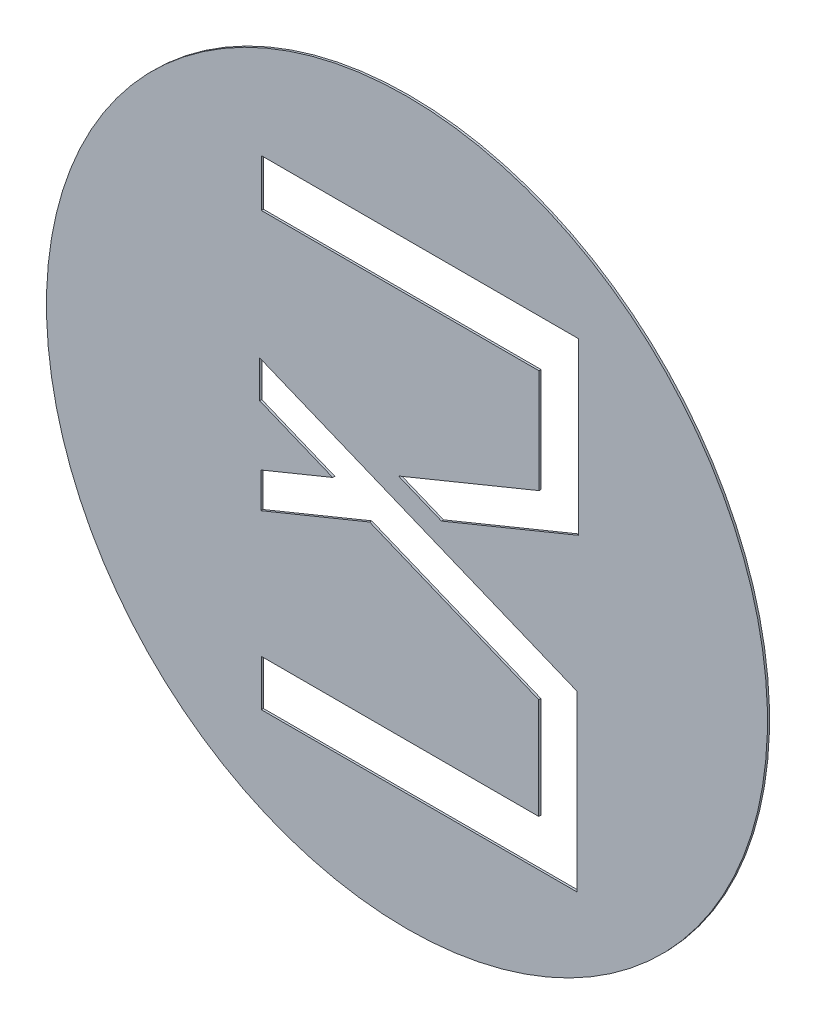
ISO-10303-21;
HEADER;
FILE_DESCRIPTION(('STEP AP214'),'2;1');
FILE_NAME('part.step','',(''),(''),'','','');
FILE_SCHEMA(('AUTOMOTIVE_DESIGN { 1 0 10303 214 1 1 1 1 }'));
ENDSEC;
DATA;
#1=APPLICATION_CONTEXT('core data for automotive mechanical design processes');
#2=APPLICATION_PROTOCOL_DEFINITION('international standard','automotive_design',2000,#1);
#3=PRODUCT_CONTEXT('',#1,'mechanical');
#4=PRODUCT('Part','Part','',(#3));
#5=PRODUCT_RELATED_PRODUCT_CATEGORY('part','',(#4));
#6=PRODUCT_DEFINITION_FORMATION('','',#4);
#7=PRODUCT_DEFINITION_CONTEXT('part definition',#1,'design');
#8=PRODUCT_DEFINITION('design','',#6,#7);
#9=PRODUCT_DEFINITION_SHAPE('','',#8);
#10=(LENGTH_UNIT() NAMED_UNIT(*) SI_UNIT(.MILLI.,.METRE.));
#11=(NAMED_UNIT(*) PLANE_ANGLE_UNIT() SI_UNIT($,.RADIAN.));
#12=(NAMED_UNIT(*) SI_UNIT($,.STERADIAN.) SOLID_ANGLE_UNIT());
#13=UNCERTAINTY_MEASURE_WITH_UNIT(LENGTH_MEASURE(1.E-05),#10,'distance_accuracy_value','');
#14=(GEOMETRIC_REPRESENTATION_CONTEXT(3) GLOBAL_UNCERTAINTY_ASSIGNED_CONTEXT((#13)) GLOBAL_UNIT_ASSIGNED_CONTEXT((#10,
#11,#12)) REPRESENTATION_CONTEXT('',''));
#15=CARTESIAN_POINT('',(0.,0.,0.));
#16=DIRECTION('',(0.,0.,1.));
#17=DIRECTION('',(1.,0.,0.));
#18=AXIS2_PLACEMENT_3D('',#15,#16,#17);
#19=CARTESIAN_POINT('',(1.1645974941225,1.6099234272431,1.74900000742));
#20=DIRECTION('',(1.,0.,0.));
#21=DIRECTION('',(0.,0.,-1.));
#22=AXIS2_PLACEMENT_3D('',#19,#20,#21);
#23=PLANE('',#22);
#24=DIRECTION('',(0.,0.,1.));
#25=VECTOR('',#24,1.);
#26=CARTESIAN_POINT('',(1.1645974941225,1.6266998240997,1.74900000742));
#27=LINE('',#26,#25);
#28=CARTESIAN_POINT('',(1.1645974941225,1.6266998240997,1.74900000742));
#29=VERTEX_POINT('',#28);
#30=CARTESIAN_POINT('',(1.1645974941225,1.6266998240997,1.74940000742));
#31=VERTEX_POINT('',#30);
#32=EDGE_CURVE('E11',#29,#31,#27,.T.);
#33=ORIENTED_EDGE('',*,*,#32,.F.);
#34=DIRECTION('',(0.,1.,0.));
#35=VECTOR('',#34,1.);
#36=CARTESIAN_POINT('',(1.1645974941225,1.5931470303865,1.74900000742));
#37=LINE('',#36,#35);
#38=CARTESIAN_POINT('',(1.1645974941225,1.5931470303865,1.74900000742));
#39=VERTEX_POINT('',#38);
#40=EDGE_CURVE('E24',#39,#29,#37,.T.);
#41=ORIENTED_EDGE('',*,*,#40,.F.);
#42=DIRECTION('',(0.,0.,1.));
#43=VECTOR('',#42,1.);
#44=CARTESIAN_POINT('',(1.1645974941225,1.5931470303865,1.74900000742));
#45=LINE('',#44,#43);
#46=CARTESIAN_POINT('',(1.1645974941225,1.5931470303865,1.74940000742));
#47=VERTEX_POINT('',#46);
#48=EDGE_CURVE('E322',#39,#47,#45,.T.);
#49=ORIENTED_EDGE('',*,*,#48,.T.);
#50=DIRECTION('',(0.,-1.,0.));
#51=VECTOR('',#50,1.);
#52=CARTESIAN_POINT('',(1.1645974941225,1.6266998240997,1.74940000742));
#53=LINE('',#52,#51);
#54=EDGE_CURVE('E319',#31,#47,#53,.T.);
#55=ORIENTED_EDGE('',*,*,#54,.F.);
#56=EDGE_LOOP('',(#33,#41,#49,#55));
#57=FACE_BOUND('',#56,.T.);
#58=ADVANCED_FACE('F17',(#57),#23,.F.);
#59=CARTESIAN_POINT('',(1.1341423982248,1.5931470303865,1.74900000742));
#60=DIRECTION('',(0.,-1.,0.));
#61=DIRECTION('',(0.,0.,-1.));
#62=AXIS2_PLACEMENT_3D('',#59,#60,#61);
#63=PLANE('',#62);
#64=ORIENTED_EDGE('',*,*,#48,.F.);
#65=DIRECTION('',(1.,0.,0.));
#66=VECTOR('',#65,1.);
#67=CARTESIAN_POINT('',(1.1036873023271,1.5931470303865,1.74900000742));
#68=LINE('',#67,#66);
#69=CARTESIAN_POINT('',(1.1036873023271,1.5931470303865,1.74900000742));
#70=VERTEX_POINT('',#69);
#71=EDGE_CURVE('E316',#70,#39,#68,.T.);
#72=ORIENTED_EDGE('',*,*,#71,.F.);
#73=DIRECTION('',(0.,0.,1.));
#74=VECTOR('',#73,1.);
#75=CARTESIAN_POINT('',(1.1036873023271,1.5931470303865,1.74900000742));
#76=LINE('',#75,#74);
#77=CARTESIAN_POINT('',(1.1036873023271,1.5931470303865,1.74940000742));
#78=VERTEX_POINT('',#77);
#79=EDGE_CURVE('E314',#70,#78,#76,.T.);
#80=ORIENTED_EDGE('',*,*,#79,.T.);
#81=DIRECTION('',(-1.,0.,0.));
#82=VECTOR('',#81,1.);
#83=CARTESIAN_POINT('',(1.1645974941225,1.5931470303865,1.74940000742));
#84=LINE('',#83,#82);
#85=EDGE_CURVE('E311',#47,#78,#84,.T.);
#86=ORIENTED_EDGE('',*,*,#85,.F.);
#87=EDGE_LOOP('',(#64,#72,#80,#86));
#88=FACE_BOUND('',#87,.T.);
#89=ADVANCED_FACE('F368',(#88),#63,.F.);
#90=CARTESIAN_POINT('',(1.1036873023271,1.5976076616901,1.74900000742));
#91=DIRECTION('',(-1.,0.,0.));
#92=DIRECTION('',(0.,0.,1.));
#93=AXIS2_PLACEMENT_3D('',#90,#91,#92);
#94=PLANE('',#93);
#95=ORIENTED_EDGE('',*,*,#79,.F.);
#96=DIRECTION('',(0.,-1.,0.));
#97=VECTOR('',#96,1.);
#98=CARTESIAN_POINT('',(1.1036873023271,1.6020682929937,1.74900000742));
#99=LINE('',#98,#97);
#100=CARTESIAN_POINT('',(1.1036873023271,1.6020682929937,1.74900000742));
#101=VERTEX_POINT('',#100);
#102=EDGE_CURVE('E308',#101,#70,#99,.T.);
#103=ORIENTED_EDGE('',*,*,#102,.F.);
#104=DIRECTION('',(0.,0.,1.));
#105=VECTOR('',#104,1.);
#106=CARTESIAN_POINT('',(1.1036873023271,1.6020682929937,1.74900000742));
#107=LINE('',#106,#105);
#108=CARTESIAN_POINT('',(1.1036873023271,1.6020682929937,1.74940000742));
#109=VERTEX_POINT('',#108);
#110=EDGE_CURVE('E306',#101,#109,#107,.T.);
#111=ORIENTED_EDGE('',*,*,#110,.T.);
#112=DIRECTION('',(0.,1.,0.));
#113=VECTOR('',#112,1.);
#114=CARTESIAN_POINT('',(1.1036873023271,1.5931470303865,1.74940000742));
#115=LINE('',#114,#113);
#116=EDGE_CURVE('E303',#78,#109,#115,.T.);
#117=ORIENTED_EDGE('',*,*,#116,.F.);
#118=EDGE_LOOP('',(#95,#103,#111,#117));
#119=FACE_BOUND('',#118,.T.);
#120=ADVANCED_FACE('F365',(#119),#94,.F.);
#121=CARTESIAN_POINT('',(1.1304576992269,1.6020682929937,1.74900000742));
#122=DIRECTION('',(0.,1.,0.));
#123=DIRECTION('',(0.,0.,1.));
#124=AXIS2_PLACEMENT_3D('',#121,#122,#123);
#125=PLANE('',#124);
#126=ORIENTED_EDGE('',*,*,#110,.F.);
#127=DIRECTION('',(-1.,0.,0.));
#128=VECTOR('',#127,1.);
#129=CARTESIAN_POINT('',(1.1572280961267,1.6020682929937,1.74900000742));
#130=LINE('',#129,#128);
#131=CARTESIAN_POINT('',(1.1572280961267,1.6020682929937,1.74900000742));
#132=VERTEX_POINT('',#131);
#133=EDGE_CURVE('E300',#132,#101,#130,.T.);
#134=ORIENTED_EDGE('',*,*,#133,.F.);
#135=DIRECTION('',(0.,0.,1.));
#136=VECTOR('',#135,1.);
#137=CARTESIAN_POINT('',(1.1572280961267,1.6020682929937,1.74900000742));
#138=LINE('',#137,#136);
#139=CARTESIAN_POINT('',(1.1572280961267,1.6020682929937,1.74940000742));
#140=VERTEX_POINT('',#139);
#141=EDGE_CURVE('E298',#132,#140,#138,.T.);
#142=ORIENTED_EDGE('',*,*,#141,.T.);
#143=DIRECTION('',(1.,0.,0.));
#144=VECTOR('',#143,1.);
#145=CARTESIAN_POINT('',(1.1036873023271,1.6020682929937,1.74940000742));
#146=LINE('',#145,#144);
#147=EDGE_CURVE('E295',#109,#140,#146,.T.);
#148=ORIENTED_EDGE('',*,*,#147,.F.);
#149=EDGE_LOOP('',(#126,#134,#142,#148));
#150=FACE_BOUND('',#149,.T.);
#151=ADVANCED_FACE('F362',(#150),#125,.F.);
#152=CARTESIAN_POINT('',(1.1572280961267,1.6118292382753,1.74900000742));
#153=DIRECTION('',(-1.,0.,0.));
#154=DIRECTION('',(0.,0.,1.));
#155=AXIS2_PLACEMENT_3D('',#152,#153,#154);
#156=PLANE('',#155);
#157=ORIENTED_EDGE('',*,*,#141,.F.);
#158=DIRECTION('',(0.,-1.,0.));
#159=VECTOR('',#158,1.);
#160=CARTESIAN_POINT('',(1.1572280961267,1.6215901835569,1.74900000742));
#161=LINE('',#160,#159);
#162=CARTESIAN_POINT('',(1.1572280961267,1.6215901835569,1.74900000742));
#163=VERTEX_POINT('',#162);
#164=EDGE_CURVE('E292',#163,#132,#161,.T.);
#165=ORIENTED_EDGE('',*,*,#164,.F.);
#166=DIRECTION('',(0.,0.,1.));
#167=VECTOR('',#166,1.);
#168=CARTESIAN_POINT('',(1.1572280961267,1.6215901835569,1.74900000742));
#169=LINE('',#168,#167);
#170=CARTESIAN_POINT('',(1.1572280961267,1.6215901835569,1.74940000742));
#171=VERTEX_POINT('',#170);
#172=EDGE_CURVE('E290',#163,#171,#169,.T.);
#173=ORIENTED_EDGE('',*,*,#172,.T.);
#174=DIRECTION('',(0.,1.,0.));
#175=VECTOR('',#174,1.);
#176=CARTESIAN_POINT('',(1.1572280961267,1.6020682929937,1.74940000742));
#177=LINE('',#176,#175);
#178=EDGE_CURVE('E287',#140,#171,#177,.T.);
#179=ORIENTED_EDGE('',*,*,#178,.F.);
#180=EDGE_LOOP('',(#157,#165,#173,#179));
#181=FACE_BOUND('',#180,.T.);
#182=ADVANCED_FACE('F357',(#181),#156,.F.);
#183=CARTESIAN_POINT('',(1.1409088175475,1.6282781100725,1.74900000742));
#184=DIRECTION('',(-0.3792087365128,-0.925311155316073,0.));
#185=DIRECTION('',(0.,0.,-1.));
#186=AXIS2_PLACEMENT_3D('',#183,#184,#185);
#187=PLANE('',#186);
#188=ORIENTED_EDGE('',*,*,#172,.F.);
#189=DIRECTION('',(0.925311155316073,-0.3792087365128,0.));
#190=VECTOR('',#189,1.);
#191=CARTESIAN_POINT('',(1.1245895389683,1.6349660365881,1.74900000742));
#192=LINE('',#191,#190);
#193=CARTESIAN_POINT('',(1.1245895389683,1.6349660365881,1.74900000742));
#194=VERTEX_POINT('',#193);
#195=EDGE_CURVE('E284',#194,#163,#192,.T.);
#196=ORIENTED_EDGE('',*,*,#195,.F.);
#197=DIRECTION('',(0.,0.,1.));
#198=VECTOR('',#197,1.);
#199=CARTESIAN_POINT('',(1.1245895389683,1.6349660365881,1.74900000742));
#200=LINE('',#199,#198);
#201=CARTESIAN_POINT('',(1.1245895389683,1.6349660365881,1.74940000742));
#202=VERTEX_POINT('',#201);
#203=EDGE_CURVE('E282',#194,#202,#200,.T.);
#204=ORIENTED_EDGE('',*,*,#203,.T.);
#205=DIRECTION('',(-0.925311155316073,0.3792087365128,0.));
#206=VECTOR('',#205,1.);
#207=CARTESIAN_POINT('',(1.1572280961267,1.6215901835569,1.74940000742));
#208=LINE('',#207,#206);
#209=EDGE_CURVE('E279',#171,#202,#208,.T.);
#210=ORIENTED_EDGE('',*,*,#209,.F.);
#211=EDGE_LOOP('',(#188,#196,#204,#210));
#212=FACE_BOUND('',#211,.T.);
#213=ADVANCED_FACE('F353',(#212),#187,.F.);
#214=CARTESIAN_POINT('',(1.1140937586507,1.6306646817735,1.74900000742));
#215=DIRECTION('',(0.379208736510258,-0.925311155317115,0.));
#216=DIRECTION('',(0.,0.,-1.));
#217=AXIS2_PLACEMENT_3D('',#214,#215,#216);
#218=PLANE('',#217);
#219=ORIENTED_EDGE('',*,*,#203,.F.);
#220=DIRECTION('',(0.925311155317115,0.379208736510258,0.));
#221=VECTOR('',#220,1.);
#222=CARTESIAN_POINT('',(1.1035979783331,1.6263633269589,1.74900000742));
#223=LINE('',#222,#221);
#224=CARTESIAN_POINT('',(1.1035979783331,1.6263633269589,1.74900000742));
#225=VERTEX_POINT('',#224);
#226=EDGE_CURVE('E276',#225,#194,#223,.T.);
#227=ORIENTED_EDGE('',*,*,#226,.F.);
#228=DIRECTION('',(0.,0.,1.));
#229=VECTOR('',#228,1.);
#230=CARTESIAN_POINT('',(1.1035979783331,1.6263633269589,1.74900000742));
#231=LINE('',#230,#229);
#232=CARTESIAN_POINT('',(1.1035979783331,1.6263633269589,1.74940000742));
#233=VERTEX_POINT('',#232);
#234=EDGE_CURVE('E274',#225,#233,#231,.T.);
#235=ORIENTED_EDGE('',*,*,#234,.T.);
#236=DIRECTION('',(-0.925311155317115,-0.379208736510258,0.));
#237=VECTOR('',#236,1.);
#238=CARTESIAN_POINT('',(1.1245895389683,1.6349660365881,1.74940000742));
#239=LINE('',#238,#237);
#240=EDGE_CURVE('E271',#202,#233,#239,.T.);
#241=ORIENTED_EDGE('',*,*,#240,.F.);
#242=EDGE_LOOP('',(#219,#227,#235,#241));
#243=FACE_BOUND('',#242,.T.);
#244=ADVANCED_FACE('F350',(#243),#218,.F.);
#245=CARTESIAN_POINT('',(1.1035979783331,1.6297657873966,1.74900000742));
#246=DIRECTION('',(-1.,0.,0.));
#247=DIRECTION('',(0.,0.,1.));
#248=AXIS2_PLACEMENT_3D('',#245,#246,#247);
#249=PLANE('',#248);
#250=ORIENTED_EDGE('',*,*,#234,.F.);
#251=DIRECTION('',(0.,-1.,0.));
#252=VECTOR('',#251,1.);
#253=CARTESIAN_POINT('',(1.1035979783331,1.6331682478343,1.74900000742));
#254=LINE('',#253,#252);
#255=CARTESIAN_POINT('',(1.1035979783331,1.6331682478343,1.74900000742));
#256=VERTEX_POINT('',#255);
#257=EDGE_CURVE('E268',#256,#225,#254,.T.);
#258=ORIENTED_EDGE('',*,*,#257,.F.);
#259=DIRECTION('',(0.,0.,1.));
#260=VECTOR('',#259,1.);
#261=CARTESIAN_POINT('',(1.1035979783331,1.6331682478343,1.74900000742));
#262=LINE('',#261,#260);
#263=CARTESIAN_POINT('',(1.1035979783331,1.6331682478343,1.74940000742));
#264=VERTEX_POINT('',#263);
#265=EDGE_CURVE('E266',#256,#264,#262,.T.);
#266=ORIENTED_EDGE('',*,*,#265,.T.);
#267=DIRECTION('',(0.,1.,0.));
#268=VECTOR('',#267,1.);
#269=CARTESIAN_POINT('',(1.1035979783331,1.6263633269589,1.74940000742));
#270=LINE('',#269,#268);
#271=EDGE_CURVE('E263',#233,#264,#270,.T.);
#272=ORIENTED_EDGE('',*,*,#271,.F.);
#273=EDGE_LOOP('',(#250,#258,#266,#272));
#274=FACE_BOUND('',#273,.T.);
#275=ADVANCED_FACE('F345',(#274),#249,.F.);
#276=CARTESIAN_POINT('',(1.1105306535751,1.636009379711,1.74900000742));
#277=DIRECTION('',(-0.379208736520485,0.925311155312924,0.));
#278=DIRECTION('',(0.,0.,1.));
#279=AXIS2_PLACEMENT_3D('',#276,#277,#278);
#280=PLANE('',#279);
#281=ORIENTED_EDGE('',*,*,#265,.F.);
#282=DIRECTION('',(-0.925311155312924,-0.379208736520485,0.));
#283=VECTOR('',#282,1.);
#284=CARTESIAN_POINT('',(1.1174633288171,1.6388505115877,1.74900000742));
#285=LINE('',#284,#283);
#286=CARTESIAN_POINT('',(1.1174633288171,1.6388505115877,1.74900000742));
#287=VERTEX_POINT('',#286);
#288=EDGE_CURVE('E260',#287,#256,#285,.T.);
#289=ORIENTED_EDGE('',*,*,#288,.F.);
#290=DIRECTION('',(0.,0.,1.));
#291=VECTOR('',#290,1.);
#292=CARTESIAN_POINT('',(1.1174633288171,1.6388505115877,1.74900000742));
#293=LINE('',#292,#291);
#294=CARTESIAN_POINT('',(1.1174633288171,1.6388505115877,1.74940000742));
#295=VERTEX_POINT('',#294);
#296=EDGE_CURVE('E258',#287,#295,#293,.T.);
#297=ORIENTED_EDGE('',*,*,#296,.T.);
#298=DIRECTION('',(0.925311155312924,0.379208736520485,0.));
#299=VECTOR('',#298,1.);
#300=CARTESIAN_POINT('',(1.1035979783331,1.6331682478343,1.74940000742));
#301=LINE('',#300,#299);
#302=EDGE_CURVE('E255',#264,#295,#301,.T.);
#303=ORIENTED_EDGE('',*,*,#302,.F.);
#304=EDGE_LOOP('',(#281,#289,#297,#303));
#305=FACE_BOUND('',#304,.T.);
#306=ADVANCED_FACE('F341',(#305),#280,.F.);
#307=CARTESIAN_POINT('',(1.1104207253393,1.6417366939829,1.74900000742));
#308=DIRECTION('',(-0.379208736510154,-0.925311155317158,0.));
#309=DIRECTION('',(0.,0.,-1.));
#310=AXIS2_PLACEMENT_3D('',#307,#308,#309);
#311=PLANE('',#310);
#312=ORIENTED_EDGE('',*,*,#296,.F.);
#313=DIRECTION('',(0.925311155317158,-0.379208736510153,0.));
#314=VECTOR('',#313,1.);
#315=CARTESIAN_POINT('',(1.1033781218615,1.6446228763781,1.74900000742));
#316=LINE('',#315,#314);
#317=CARTESIAN_POINT('',(1.1033781218615,1.6446228763781,1.74900000742));
#318=VERTEX_POINT('',#317);
#319=EDGE_CURVE('E252',#318,#287,#316,.T.);
#320=ORIENTED_EDGE('',*,*,#319,.F.);
#321=DIRECTION('',(0.,0.,1.));
#322=VECTOR('',#321,1.);
#323=CARTESIAN_POINT('',(1.1033781218615,1.6446228763781,1.74900000742));
#324=LINE('',#323,#322);
#325=CARTESIAN_POINT('',(1.1033781218615,1.6446228763781,1.74940000742));
#326=VERTEX_POINT('',#325);
#327=EDGE_CURVE('E250',#318,#326,#324,.T.);
#328=ORIENTED_EDGE('',*,*,#327,.T.);
#329=DIRECTION('',(-0.925311155317158,0.379208736510153,0.));
#330=VECTOR('',#329,1.);
#331=CARTESIAN_POINT('',(1.1174633288171,1.6388505115877,1.74940000742));
#332=LINE('',#331,#330);
#333=EDGE_CURVE('E247',#295,#326,#332,.T.);
#334=ORIENTED_EDGE('',*,*,#333,.F.);
#335=EDGE_LOOP('',(#312,#320,#328,#334));
#336=FACE_BOUND('',#335,.T.);
#337=ADVANCED_FACE('F338',(#336),#311,.F.);
#338=CARTESIAN_POINT('',(1.1033781218615,1.6482057363472,1.74900000742));
#339=DIRECTION('',(-1.,0.,0.));
#340=DIRECTION('',(0.,0.,1.));
#341=AXIS2_PLACEMENT_3D('',#338,#339,#340);
#342=PLANE('',#341);
#343=ORIENTED_EDGE('',*,*,#327,.F.);
#344=DIRECTION('',(0.,-1.,0.));
#345=VECTOR('',#344,1.);
#346=CARTESIAN_POINT('',(1.1033781218615,1.6517885963163,1.74900000742));
#347=LINE('',#346,#345);
#348=CARTESIAN_POINT('',(1.1033781218615,1.6517885963163,1.74900000742));
#349=VERTEX_POINT('',#348);
#350=EDGE_CURVE('E244',#349,#318,#347,.T.);
#351=ORIENTED_EDGE('',*,*,#350,.F.);
#352=DIRECTION('',(0.,0.,1.));
#353=VECTOR('',#352,1.);
#354=CARTESIAN_POINT('',(1.1033781218615,1.6517885963163,1.74900000742));
#355=LINE('',#354,#353);
#356=CARTESIAN_POINT('',(1.1033781218615,1.6517885963163,1.74940000742));
#357=VERTEX_POINT('',#356);
#358=EDGE_CURVE('E242',#349,#357,#355,.T.);
#359=ORIENTED_EDGE('',*,*,#358,.T.);
#360=DIRECTION('',(0.,1.,0.));
#361=VECTOR('',#360,1.);
#362=CARTESIAN_POINT('',(1.1033781218615,1.6446228763781,1.74940000742));
#363=LINE('',#362,#361);
#364=EDGE_CURVE('E239',#326,#357,#363,.T.);
#365=ORIENTED_EDGE('',*,*,#364,.F.);
#366=EDGE_LOOP('',(#343,#351,#359,#365));
#367=FACE_BOUND('',#366,.T.);
#368=ADVANCED_FACE('F332',(#367),#342,.F.);
#369=CARTESIAN_POINT('',(1.133987807992,1.639244210208,1.74900000742));
#370=DIRECTION('',(0.379208736512847,0.925311155316054,0.));
#371=DIRECTION('',(0.,0.,1.));
#372=AXIS2_PLACEMENT_3D('',#369,#370,#371);
#373=PLANE('',#372);
#374=ORIENTED_EDGE('',*,*,#358,.F.);
#375=DIRECTION('',(-0.925311155316054,0.379208736512847,0.));
#376=VECTOR('',#375,1.);
#377=CARTESIAN_POINT('',(1.1645974941225,1.6266998240997,1.74900000742));
#378=LINE('',#377,#376);
#379=EDGE_CURVE('E236',#29,#349,#378,.T.);
#380=ORIENTED_EDGE('',*,*,#379,.F.);
#381=ORIENTED_EDGE('',*,*,#32,.T.);
#382=DIRECTION('',(0.925311155316054,-0.379208736512847,0.));
#383=VECTOR('',#382,1.);
#384=CARTESIAN_POINT('',(1.1033781218615,1.6517885963163,1.74940000742));
#385=LINE('',#384,#383);
#386=EDGE_CURVE('E233',#357,#31,#385,.T.);
#387=ORIENTED_EDGE('',*,*,#386,.F.);
#388=EDGE_LOOP('',(#374,#380,#381,#387));
#389=FACE_BOUND('',#388,.T.);
#390=ADVANCED_FACE('F328',(#389),#373,.F.);
#391=CARTESIAN_POINT('',(1.1516789251632,1.6474781309268,1.74900000742));
#392=DIRECTION('',(0.379208736513062,-0.925311155315966,0.));
#393=DIRECTION('',(0.,0.,-1.));
#394=AXIS2_PLACEMENT_3D('',#391,#392,#393);
#395=PLANE('',#394);
#396=DIRECTION('',(0.,0.,1.));
#397=VECTOR('',#396,1.);
#398=CARTESIAN_POINT('',(1.1649066745881,1.6528990945859,1.74900000742));
#399=LINE('',#398,#397);
#400=CARTESIAN_POINT('',(1.1649066745881,1.6528990945859,1.74900000742));
#401=VERTEX_POINT('',#400);
#402=CARTESIAN_POINT('',(1.1649066745881,1.6528990945859,1.74940000742));
#403=VERTEX_POINT('',#402);
#404=EDGE_CURVE('E231',#401,#403,#399,.T.);
#405=ORIENTED_EDGE('',*,*,#404,.F.);
#406=DIRECTION('',(0.925311155315966,0.379208736513061,0.));
#407=VECTOR('',#406,1.);
#408=CARTESIAN_POINT('',(1.1384511757383,1.6420571672677,1.74900000742));
#409=LINE('',#408,#407);
#410=CARTESIAN_POINT('',(1.1384511757383,1.6420571672677,1.74900000742));
#411=VERTEX_POINT('',#410);
#412=EDGE_CURVE('E228',#411,#401,#409,.T.);
#413=ORIENTED_EDGE('',*,*,#412,.F.);
#414=DIRECTION('',(0.,0.,1.));
#415=VECTOR('',#414,1.);
#416=CARTESIAN_POINT('',(1.1384511757383,1.6420571672677,1.74900000742));
#417=LINE('',#416,#415);
#418=CARTESIAN_POINT('',(1.1384511757383,1.6420571672677,1.74940000742));
#419=VERTEX_POINT('',#418);
#420=EDGE_CURVE('E226',#411,#419,#417,.T.);
#421=ORIENTED_EDGE('',*,*,#420,.T.);
#422=DIRECTION('',(-0.925311155315966,-0.379208736513061,0.));
#423=VECTOR('',#422,1.);
#424=CARTESIAN_POINT('',(1.1649066745881,1.6528990945859,1.74940000742));
#425=LINE('',#424,#423);
#426=EDGE_CURVE('E223',#403,#419,#425,.T.);
#427=ORIENTED_EDGE('',*,*,#426,.F.);
#428=EDGE_LOOP('',(#405,#413,#421,#427));
#429=FACE_BOUND('',#428,.T.);
#430=ADVANCED_FACE('F397',(#429),#395,.F.);
#431=CARTESIAN_POINT('',(1.134313626981,1.6437528072992,1.74900000742));
#432=DIRECTION('',(-0.379208736519346,-0.92531115531339,0.));
#433=DIRECTION('',(0.,0.,-1.));
#434=AXIS2_PLACEMENT_3D('',#431,#432,#433);
#435=PLANE('',#434);
#436=ORIENTED_EDGE('',*,*,#420,.F.);
#437=DIRECTION('',(0.92531115531339,-0.379208736519346,0.));
#438=VECTOR('',#437,1.);
#439=CARTESIAN_POINT('',(1.1301760782237,1.6454484473307,1.74900000742));
#440=LINE('',#439,#438);
#441=CARTESIAN_POINT('',(1.1301760782237,1.6454484473307,1.74900000742));
#442=VERTEX_POINT('',#441);
#443=EDGE_CURVE('E220',#442,#411,#440,.T.);
#444=ORIENTED_EDGE('',*,*,#443,.F.);
#445=DIRECTION('',(0.,0.,1.));
#446=VECTOR('',#445,1.);
#447=CARTESIAN_POINT('',(1.1301760782237,1.6454484473307,1.74900000742));
#448=LINE('',#447,#446);
#449=CARTESIAN_POINT('',(1.1301760782237,1.6454484473307,1.74940000742));
#450=VERTEX_POINT('',#449);
#451=EDGE_CURVE('E218',#442,#450,#448,.T.);
#452=ORIENTED_EDGE('',*,*,#451,.T.);
#453=DIRECTION('',(-0.92531115531339,0.379208736519346,0.));
#454=VECTOR('',#453,1.);
#455=CARTESIAN_POINT('',(1.1384511757383,1.6420571672677,1.74940000742));
#456=LINE('',#455,#454);
#457=EDGE_CURVE('E215',#419,#450,#456,.T.);
#458=ORIENTED_EDGE('',*,*,#457,.F.);
#459=EDGE_LOOP('',(#436,#444,#452,#458));
#460=FACE_BOUND('',#459,.T.);
#461=ADVANCED_FACE('F400',(#460),#435,.F.);
#462=CARTESIAN_POINT('',(1.1437353635656,1.6510052802219,1.74900000742));
#463=DIRECTION('',(-0.379208736508772,0.925311155317724,0.));
#464=DIRECTION('',(0.,0.,1.));
#465=AXIS2_PLACEMENT_3D('',#462,#463,#464);
#466=PLANE('',#465);
#467=ORIENTED_EDGE('',*,*,#451,.F.);
#468=DIRECTION('',(-0.925311155317724,-0.379208736508772,0.));
#469=VECTOR('',#468,1.);
#470=CARTESIAN_POINT('',(1.1572946489075,1.6565621131131,1.74900000742));
#471=LINE('',#470,#469);
#472=CARTESIAN_POINT('',(1.1572946489075,1.6565621131131,1.74900000742));
#473=VERTEX_POINT('',#472);
#474=EDGE_CURVE('E212',#473,#442,#471,.T.);
#475=ORIENTED_EDGE('',*,*,#474,.F.);
#476=DIRECTION('',(0.,0.,1.));
#477=VECTOR('',#476,1.);
#478=CARTESIAN_POINT('',(1.1572946489075,1.6565621131131,1.74900000742));
#479=LINE('',#478,#477);
#480=CARTESIAN_POINT('',(1.1572946489075,1.6565621131131,1.74940000742));
#481=VERTEX_POINT('',#480);
#482=EDGE_CURVE('E210',#473,#481,#479,.T.);
#483=ORIENTED_EDGE('',*,*,#482,.T.);
#484=DIRECTION('',(0.925311155317724,0.379208736508772,0.));
#485=VECTOR('',#484,1.);
#486=CARTESIAN_POINT('',(1.1301760782237,1.6454484473307,1.74940000742));
#487=LINE('',#486,#485);
#488=EDGE_CURVE('E207',#450,#481,#487,.T.);
#489=ORIENTED_EDGE('',*,*,#488,.F.);
#490=EDGE_LOOP('',(#467,#475,#483,#489));
#491=FACE_BOUND('',#490,.T.);
#492=ADVANCED_FACE('F404',(#491),#466,.F.);
#493=CARTESIAN_POINT('',(1.1572946489075,1.6665789436696,1.74900000742));
#494=DIRECTION('',(-1.,0.,0.));
#495=DIRECTION('',(0.,0.,1.));
#496=AXIS2_PLACEMENT_3D('',#493,#494,#495);
#497=PLANE('',#496);
#498=ORIENTED_EDGE('',*,*,#482,.F.);
#499=DIRECTION('',(0.,-1.,0.));
#500=VECTOR('',#499,1.);
#501=CARTESIAN_POINT('',(1.1572946489075,1.6765957742261,1.74900000742));
#502=LINE('',#501,#500);
#503=CARTESIAN_POINT('',(1.1572946489075,1.6765957742261,1.74900000742));
#504=VERTEX_POINT('',#503);
#505=EDGE_CURVE('E204',#504,#473,#502,.T.);
#506=ORIENTED_EDGE('',*,*,#505,.F.);
#507=DIRECTION('',(0.,0.,1.));
#508=VECTOR('',#507,1.);
#509=CARTESIAN_POINT('',(1.1572946489075,1.6765957742261,1.74900000742));
#510=LINE('',#509,#508);
#511=CARTESIAN_POINT('',(1.1572946489075,1.6765957742261,1.74940000742));
#512=VERTEX_POINT('',#511);
#513=EDGE_CURVE('E202',#504,#512,#510,.T.);
#514=ORIENTED_EDGE('',*,*,#513,.T.);
#515=DIRECTION('',(0.,1.,0.));
#516=VECTOR('',#515,1.);
#517=CARTESIAN_POINT('',(1.1572946489075,1.6565621131131,1.74940000742));
#518=LINE('',#517,#516);
#519=EDGE_CURVE('E199',#481,#512,#518,.T.);
#520=ORIENTED_EDGE('',*,*,#519,.F.);
#521=EDGE_LOOP('',(#498,#506,#514,#520));
#522=FACE_BOUND('',#521,.T.);
#523=ADVANCED_FACE('F408',(#522),#497,.F.);
#524=CARTESIAN_POINT('',(1.1304909756173,1.6765957742261,1.74900000742));
#525=DIRECTION('',(0.,-1.,0.));
#526=DIRECTION('',(0.,0.,-1.));
#527=AXIS2_PLACEMENT_3D('',#524,#525,#526);
#528=PLANE('',#527);
#529=ORIENTED_EDGE('',*,*,#513,.F.);
#530=DIRECTION('',(1.,0.,0.));
#531=VECTOR('',#530,1.);
#532=CARTESIAN_POINT('',(1.1036873023271,1.6765957742261,1.74900000742));
#533=LINE('',#532,#531);
#534=CARTESIAN_POINT('',(1.1036873023271,1.6765957742261,1.74900000742));
#535=VERTEX_POINT('',#534);
#536=EDGE_CURVE('E196',#535,#504,#533,.T.);
#537=ORIENTED_EDGE('',*,*,#536,.F.);
#538=DIRECTION('',(0.,0.,1.));
#539=VECTOR('',#538,1.);
#540=CARTESIAN_POINT('',(1.1036873023271,1.6765957742261,1.74900000742));
#541=LINE('',#540,#539);
#542=CARTESIAN_POINT('',(1.1036873023271,1.6765957742261,1.74940000742));
#543=VERTEX_POINT('',#542);
#544=EDGE_CURVE('E194',#535,#543,#541,.T.);
#545=ORIENTED_EDGE('',*,*,#544,.T.);
#546=DIRECTION('',(-1.,0.,0.));
#547=VECTOR('',#546,1.);
#548=CARTESIAN_POINT('',(1.1572946489075,1.6765957742261,1.74940000742));
#549=LINE('',#548,#547);
#550=EDGE_CURVE('E191',#512,#543,#549,.T.);
#551=ORIENTED_EDGE('',*,*,#550,.F.);
#552=EDGE_LOOP('',(#529,#537,#545,#551));
#553=FACE_BOUND('',#552,.T.);
#554=ADVANCED_FACE('F412',(#553),#528,.F.);
#555=CARTESIAN_POINT('',(1.1036873023271,1.6811805141526,1.74900000742));
#556=DIRECTION('',(-1.,0.,0.));
#557=DIRECTION('',(0.,0.,1.));
#558=AXIS2_PLACEMENT_3D('',#555,#556,#557);
#559=PLANE('',#558);
#560=ORIENTED_EDGE('',*,*,#544,.F.);
#561=DIRECTION('',(0.,-1.,0.));
#562=VECTOR('',#561,1.);
#563=CARTESIAN_POINT('',(1.1036873023271,1.6857652540791,1.74900000742));
#564=LINE('',#563,#562);
#565=CARTESIAN_POINT('',(1.1036873023271,1.6857652540791,1.74900000742));
#566=VERTEX_POINT('',#565);
#567=EDGE_CURVE('E188',#566,#535,#564,.T.);
#568=ORIENTED_EDGE('',*,*,#567,.F.);
#569=DIRECTION('',(0.,0.,1.));
#570=VECTOR('',#569,1.);
#571=CARTESIAN_POINT('',(1.1036873023271,1.6857652540791,1.74900000742));
#572=LINE('',#571,#570);
#573=CARTESIAN_POINT('',(1.1036873023271,1.6857652540791,1.74940000742));
#574=VERTEX_POINT('',#573);
#575=EDGE_CURVE('E186',#566,#574,#572,.T.);
#576=ORIENTED_EDGE('',*,*,#575,.T.);
#577=DIRECTION('',(0.,1.,0.));
#578=VECTOR('',#577,1.);
#579=CARTESIAN_POINT('',(1.1036873023271,1.6765957742261,1.74940000742));
#580=LINE('',#579,#578);
#581=EDGE_CURVE('E183',#543,#574,#580,.T.);
#582=ORIENTED_EDGE('',*,*,#581,.F.);
#583=EDGE_LOOP('',(#560,#568,#576,#582));
#584=FACE_BOUND('',#583,.T.);
#585=ADVANCED_FACE('F416',(#584),#559,.F.);
#586=CARTESIAN_POINT('',(1.1342969884576,1.6857652540791,1.74900000742));
#587=DIRECTION('',(0.,1.,0.));
#588=DIRECTION('',(0.,0.,1.));
#589=AXIS2_PLACEMENT_3D('',#586,#587,#588);
#590=PLANE('',#589);
#591=ORIENTED_EDGE('',*,*,#575,.F.);
#592=DIRECTION('',(-1.,0.,0.));
#593=VECTOR('',#592,1.);
#594=CARTESIAN_POINT('',(1.1649066745881,1.6857652540791,1.74900000742));
#595=LINE('',#594,#593);
#596=CARTESIAN_POINT('',(1.1649066745881,1.6857652540791,1.74900000742));
#597=VERTEX_POINT('',#596);
#598=EDGE_CURVE('E180',#597,#566,#595,.T.);
#599=ORIENTED_EDGE('',*,*,#598,.F.);
#600=DIRECTION('',(0.,0.,1.));
#601=VECTOR('',#600,1.);
#602=CARTESIAN_POINT('',(1.1649066745881,1.6857652540791,1.74900000742));
#603=LINE('',#602,#601);
#604=CARTESIAN_POINT('',(1.1649066745881,1.6857652540791,1.74940000742));
#605=VERTEX_POINT('',#604);
#606=EDGE_CURVE('E178',#597,#605,#603,.T.);
#607=ORIENTED_EDGE('',*,*,#606,.T.);
#608=DIRECTION('',(1.,0.,0.));
#609=VECTOR('',#608,1.);
#610=CARTESIAN_POINT('',(1.1036873023271,1.6857652540791,1.74940000742));
#611=LINE('',#610,#609);
#612=EDGE_CURVE('E175',#574,#605,#611,.T.);
#613=ORIENTED_EDGE('',*,*,#612,.F.);
#614=EDGE_LOOP('',(#591,#599,#607,#613));
#615=FACE_BOUND('',#614,.T.);
#616=ADVANCED_FACE('F420',(#615),#590,.F.);
#617=CARTESIAN_POINT('',(1.1649066745881,1.6693321743325,1.74900000742));
#618=DIRECTION('',(1.,0.,0.));
#619=DIRECTION('',(0.,0.,-1.));
#620=AXIS2_PLACEMENT_3D('',#617,#618,#619);
#621=PLANE('',#620);
#622=ORIENTED_EDGE('',*,*,#606,.F.);
#623=DIRECTION('',(0.,1.,0.));
#624=VECTOR('',#623,1.);
#625=CARTESIAN_POINT('',(1.1649066745881,1.6528990945859,1.74900000742));
#626=LINE('',#625,#624);
#627=EDGE_CURVE('E172',#401,#597,#626,.T.);
#628=ORIENTED_EDGE('',*,*,#627,.F.);
#629=ORIENTED_EDGE('',*,*,#404,.T.);
#630=DIRECTION('',(0.,-1.,0.));
#631=VECTOR('',#630,1.);
#632=CARTESIAN_POINT('',(1.1649066745881,1.6857652540791,1.74940000742));
#633=LINE('',#632,#631);
#634=EDGE_CURVE('E169',#605,#403,#633,.T.);
#635=ORIENTED_EDGE('',*,*,#634,.F.);
#636=EDGE_LOOP('',(#622,#628,#629,#635));
#637=FACE_BOUND('',#636,.T.);
#638=ADVANCED_FACE('F424',(#637),#621,.F.);
#639=CARTESIAN_POINT('',(1.1317952072157,1.640142776453,1.74900000742));
#640=DIRECTION('',(0.,0.,-1.));
#641=DIRECTION('',(0.,1.,0.));
#642=AXIS2_PLACEMENT_3D('',#639,#640,#641);
#643=CYLINDRICAL_SURFACE('',#642,0.0695805294106385);
#644=CARTESIAN_POINT('',(1.1317952072157,1.6401427764529,1.74900000742));
#645=DIRECTION('',(0.,0.,-1.));
#646=DIRECTION('',(0.559079691050822,-0.82911392405056,0.));
#647=AXIS2_PLACEMENT_3D('',#644,#645,#646);
#648=CIRCLE('',#647,0.06958052941077);
#649=CARTESIAN_POINT('',(1.1317952072157,1.5705622470421,1.74900000742));
#650=VERTEX_POINT('',#649);
#651=EDGE_CURVE('E161',#650,#650,#648,.T.);
#652=ORIENTED_EDGE('',*,*,#651,.F.);
#653=DIRECTION('',(0.,0.,1.));
#654=VECTOR('',#653,1.);
#655=CARTESIAN_POINT('',(1.1317952072157,1.5705622470423,1.74900000742));
#656=LINE('',#655,#654);
#657=CARTESIAN_POINT('',(1.1317952072157,1.5705622470421,1.74940000742));
#658=VERTEX_POINT('',#657);
#659=EDGE_CURVE('E157',#650,#658,#656,.T.);
#660=ORIENTED_EDGE('',*,*,#659,.T.);
#661=CARTESIAN_POINT('',(1.1317952072157,1.6401427764528,1.74940000742));
#662=DIRECTION('',(0.,0.,1.));
#663=DIRECTION('',(-0.559079691050861,-0.829113924050533,0.));
#664=AXIS2_PLACEMENT_3D('',#661,#662,#663);
#665=CIRCLE('',#664,0.0695805294107593);
#666=EDGE_CURVE('E160',#658,#658,#665,.T.);
#667=ORIENTED_EDGE('',*,*,#666,.F.);
#668=ORIENTED_EDGE('',*,*,#659,.F.);
#669=EDGE_LOOP('',(#652,#660,#667,#668));
#670=FACE_BOUND('',#669,.T.);
#671=ADVANCED_FACE('F159',(#670),#643,.T.);
#672=CARTESIAN_POINT('',(1.0622146778049,1.6401427764529,1.74900000742));
#673=DIRECTION('',(0.,0.,1.));
#674=DIRECTION('',(1.,0.,0.));
#675=AXIS2_PLACEMENT_3D('',#672,#673,#674);
#676=PLANE('',#675);
#677=ORIENTED_EDGE('',*,*,#651,.T.);
#678=EDGE_LOOP('',(#677));
#679=FACE_BOUND('',#678,.T.);
#680=ORIENTED_EDGE('',*,*,#71,.T.);
#681=ORIENTED_EDGE('',*,*,#40,.T.);
#682=ORIENTED_EDGE('',*,*,#379,.T.);
#683=ORIENTED_EDGE('',*,*,#350,.T.);
#684=ORIENTED_EDGE('',*,*,#319,.T.);
#685=ORIENTED_EDGE('',*,*,#288,.T.);
#686=ORIENTED_EDGE('',*,*,#257,.T.);
#687=ORIENTED_EDGE('',*,*,#226,.T.);
#688=ORIENTED_EDGE('',*,*,#195,.T.);
#689=ORIENTED_EDGE('',*,*,#164,.T.);
#690=ORIENTED_EDGE('',*,*,#133,.T.);
#691=ORIENTED_EDGE('',*,*,#102,.T.);
#692=EDGE_LOOP('',(#680,#681,#682,#683,#684,#685,#686,#687,#688,#689,#690,#691));
#693=FACE_BOUND('',#692,.T.);
#694=ORIENTED_EDGE('',*,*,#443,.T.);
#695=ORIENTED_EDGE('',*,*,#412,.T.);
#696=ORIENTED_EDGE('',*,*,#627,.T.);
#697=ORIENTED_EDGE('',*,*,#598,.T.);
#698=ORIENTED_EDGE('',*,*,#567,.T.);
#699=ORIENTED_EDGE('',*,*,#536,.T.);
#700=ORIENTED_EDGE('',*,*,#505,.T.);
#701=ORIENTED_EDGE('',*,*,#474,.T.);
#702=EDGE_LOOP('',(#694,#695,#696,#697,#698,#699,#700,#701));
#703=FACE_BOUND('',#702,.T.);
#704=ADVANCED_FACE('F324',(#679,#693,#703),#676,.F.);
#705=CARTESIAN_POINT('',(1.0622146778049,1.6401427764529,1.74940000742));
#706=DIRECTION('',(0.,0.,1.));
#707=DIRECTION('',(1.,0.,0.));
#708=AXIS2_PLACEMENT_3D('',#705,#706,#707);
#709=PLANE('',#708);
#710=ORIENTED_EDGE('',*,*,#666,.T.);
#711=EDGE_LOOP('',(#710));
#712=FACE_BOUND('',#711,.T.);
#713=ORIENTED_EDGE('',*,*,#54,.T.);
#714=ORIENTED_EDGE('',*,*,#85,.T.);
#715=ORIENTED_EDGE('',*,*,#116,.T.);
#716=ORIENTED_EDGE('',*,*,#147,.T.);
#717=ORIENTED_EDGE('',*,*,#178,.T.);
#718=ORIENTED_EDGE('',*,*,#209,.T.);
#719=ORIENTED_EDGE('',*,*,#240,.T.);
#720=ORIENTED_EDGE('',*,*,#271,.T.);
#721=ORIENTED_EDGE('',*,*,#302,.T.);
#722=ORIENTED_EDGE('',*,*,#333,.T.);
#723=ORIENTED_EDGE('',*,*,#364,.T.);
#724=ORIENTED_EDGE('',*,*,#386,.T.);
#725=EDGE_LOOP('',(#713,#714,#715,#716,#717,#718,#719,#720,#721,#722,#723,#724));
#726=FACE_BOUND('',#725,.T.);
#727=ORIENTED_EDGE('',*,*,#426,.T.);
#728=ORIENTED_EDGE('',*,*,#457,.T.);
#729=ORIENTED_EDGE('',*,*,#488,.T.);
#730=ORIENTED_EDGE('',*,*,#519,.T.);
#731=ORIENTED_EDGE('',*,*,#550,.T.);
#732=ORIENTED_EDGE('',*,*,#581,.T.);
#733=ORIENTED_EDGE('',*,*,#612,.T.);
#734=ORIENTED_EDGE('',*,*,#634,.T.);
#735=EDGE_LOOP('',(#727,#728,#729,#730,#731,#732,#733,#734));
#736=FACE_BOUND('',#735,.T.);
#737=ADVANCED_FACE('F164',(#712,#726,#736),#709,.T.);
#738=CLOSED_SHELL('',(#58,#89,#120,#151,#182,#213,#244,#275,#306,#337,#368,#390,#430,#461,#492,
#523,#554,#585,#616,#638,#671,#704,#737));
#739=MANIFOLD_SOLID_BREP('B1',#738);
#740=ADVANCED_BREP_SHAPE_REPRESENTATION('',(#18,#739),#14);
#741=SHAPE_DEFINITION_REPRESENTATION(#9,#740);
ENDSEC;
END-ISO-10303-21;
